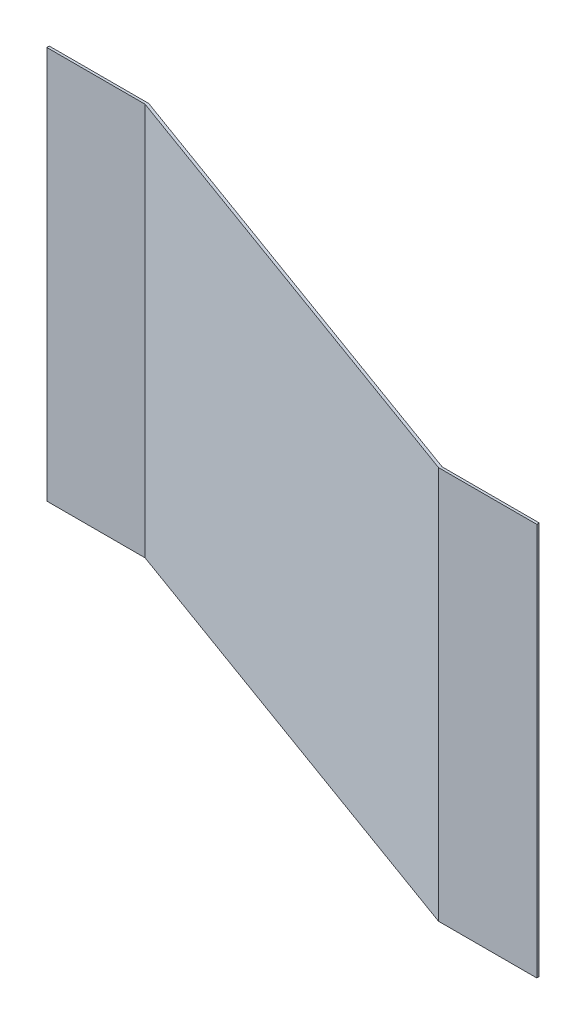
ISO-10303-21;
HEADER;
FILE_DESCRIPTION(('STEP AP214'),'2;1');
FILE_NAME('part.step','',(''),(''),'','','');
FILE_SCHEMA(('AUTOMOTIVE_DESIGN { 1 0 10303 214 1 1 1 1 }'));
ENDSEC;
DATA;
#1=APPLICATION_CONTEXT('core data for automotive mechanical design processes');
#2=APPLICATION_PROTOCOL_DEFINITION('international standard','automotive_design',2000,#1);
#3=PRODUCT_CONTEXT('',#1,'mechanical');
#4=PRODUCT('Part','Part','',(#3));
#5=PRODUCT_RELATED_PRODUCT_CATEGORY('part','',(#4));
#6=PRODUCT_DEFINITION_FORMATION('','',#4);
#7=PRODUCT_DEFINITION_CONTEXT('part definition',#1,'design');
#8=PRODUCT_DEFINITION('design','',#6,#7);
#9=PRODUCT_DEFINITION_SHAPE('','',#8);
#10=(LENGTH_UNIT() NAMED_UNIT(*) SI_UNIT(.MILLI.,.METRE.));
#11=(NAMED_UNIT(*) PLANE_ANGLE_UNIT() SI_UNIT($,.RADIAN.));
#12=(NAMED_UNIT(*) SI_UNIT($,.STERADIAN.) SOLID_ANGLE_UNIT());
#13=UNCERTAINTY_MEASURE_WITH_UNIT(LENGTH_MEASURE(1.E-05),#10,'distance_accuracy_value','');
#14=(GEOMETRIC_REPRESENTATION_CONTEXT(3) GLOBAL_UNCERTAINTY_ASSIGNED_CONTEXT((#13)) GLOBAL_UNIT_ASSIGNED_CONTEXT((#10,
#11,#12)) REPRESENTATION_CONTEXT('',''));
#15=CARTESIAN_POINT('',(0.,0.,0.));
#16=DIRECTION('',(0.,0.,1.));
#17=DIRECTION('',(1.,0.,0.));
#18=AXIS2_PLACEMENT_3D('',#15,#16,#17);
#19=CARTESIAN_POINT('',(-10131.3319774997,40000.,0.));
#20=DIRECTION('',(0.,0.,1.));
#21=DIRECTION('',(1.,0.,0.));
#22=AXIS2_PLACEMENT_3D('',#19,#20,#21);
#23=PLANE('',#22);
#24=DIRECTION('',(-1.,0.,0.));
#25=VECTOR('',#24,1.);
#26=CARTESIAN_POINT('',(-10131.3319774997,0.,0.));
#27=LINE('',#26,#25);
#28=CARTESIAN_POINT('',(0.,0.,0.));
#29=VERTEX_POINT('',#28);
#30=CARTESIAN_POINT('',(-10131.3319774997,0.,0.));
#31=VERTEX_POINT('',#30);
#32=EDGE_CURVE('E91',#29,#31,#27,.T.);
#33=ORIENTED_EDGE('',*,*,#32,.T.);
#34=DIRECTION('',(0.,-1.,0.));
#35=VECTOR('',#34,1.);
#36=CARTESIAN_POINT('',(-10131.3319774997,40000.,0.));
#37=LINE('',#36,#35);
#38=CARTESIAN_POINT('',(-10131.3319774997,40000.,0.));
#39=VERTEX_POINT('',#38);
#40=EDGE_CURVE('E11',#39,#31,#37,.T.);
#41=ORIENTED_EDGE('',*,*,#40,.F.);
#42=DIRECTION('',(-1.,0.,0.));
#43=VECTOR('',#42,1.);
#44=CARTESIAN_POINT('',(0.,40000.,0.));
#45=LINE('',#44,#43);
#46=CARTESIAN_POINT('',(0.,40000.,0.));
#47=VERTEX_POINT('',#46);
#48=EDGE_CURVE('E97',#47,#39,#45,.T.);
#49=ORIENTED_EDGE('',*,*,#48,.F.);
#50=DIRECTION('',(0.,-1.,0.));
#51=VECTOR('',#50,1.);
#52=CARTESIAN_POINT('',(0.,40000.,0.));
#53=LINE('',#52,#51);
#54=EDGE_CURVE('E131',#47,#29,#53,.T.);
#55=ORIENTED_EDGE('',*,*,#54,.T.);
#56=EDGE_LOOP('',(#33,#41,#49,#55));
#57=FACE_BOUND('',#56,.T.);
#58=ADVANCED_FACE('F39',(#57),#23,.F.);
#59=CARTESIAN_POINT('',(-10131.3319774997,40000.,250.000000000001));
#60=DIRECTION('',(1.,0.,0.));
#61=DIRECTION('',(0.,0.,-1.));
#62=AXIS2_PLACEMENT_3D('',#59,#60,#61);
#63=PLANE('',#62);
#64=DIRECTION('',(0.,0.,1.));
#65=VECTOR('',#64,1.);
#66=CARTESIAN_POINT('',(-10131.3319774997,0.,250.000000000001));
#67=LINE('',#66,#65);
#68=CARTESIAN_POINT('',(-10131.3319774997,0.,250.000000000001));
#69=VERTEX_POINT('',#68);
#70=EDGE_CURVE('E136',#31,#69,#67,.T.);
#71=ORIENTED_EDGE('',*,*,#70,.T.);
#72=DIRECTION('',(0.,-1.,0.));
#73=VECTOR('',#72,1.);
#74=CARTESIAN_POINT('',(-10131.3319774997,40000.,250.000000000001));
#75=LINE('',#74,#73);
#76=CARTESIAN_POINT('',(-10131.3319774997,40000.,250.000000000001));
#77=VERTEX_POINT('',#76);
#78=EDGE_CURVE('E47',#77,#69,#75,.T.);
#79=ORIENTED_EDGE('',*,*,#78,.F.);
#80=DIRECTION('',(0.,0.,1.));
#81=VECTOR('',#80,1.);
#82=CARTESIAN_POINT('',(-10131.3319774997,40000.,250.000000000001));
#83=LINE('',#82,#81);
#84=EDGE_CURVE('E168',#39,#77,#83,.T.);
#85=ORIENTED_EDGE('',*,*,#84,.F.);
#86=ORIENTED_EDGE('',*,*,#40,.T.);
#87=EDGE_LOOP('',(#71,#79,#85,#86));
#88=FACE_BOUND('',#87,.T.);
#89=ADVANCED_FACE('F167',(#88),#63,.F.);
#90=CARTESIAN_POINT('',(-120.740977499744,40000.,250.));
#91=DIRECTION('',(0.,0.,-1.));
#92=DIRECTION('',(-1.,0.,0.));
#93=AXIS2_PLACEMENT_3D('',#90,#91,#92);
#94=PLANE('',#93);
#95=DIRECTION('',(1.,0.,0.));
#96=VECTOR('',#95,1.);
#97=CARTESIAN_POINT('',(-120.740977499744,0.,250.));
#98=LINE('',#97,#96);
#99=CARTESIAN_POINT('',(-120.740977499744,0.,250.));
#100=VERTEX_POINT('',#99);
#101=EDGE_CURVE('E139',#69,#100,#98,.T.);
#102=ORIENTED_EDGE('',*,*,#101,.T.);
#103=DIRECTION('',(0.,-1.,0.));
#104=VECTOR('',#103,1.);
#105=CARTESIAN_POINT('',(-120.740977499744,40000.,250.));
#106=LINE('',#105,#104);
#107=CARTESIAN_POINT('',(-120.740977499744,40000.,250.));
#108=VERTEX_POINT('',#107);
#109=EDGE_CURVE('E156',#108,#100,#106,.T.);
#110=ORIENTED_EDGE('',*,*,#109,.F.);
#111=DIRECTION('',(1.,0.,0.));
#112=VECTOR('',#111,1.);
#113=CARTESIAN_POINT('',(-131.331977499744,40000.,250.));
#114=LINE('',#113,#112);
#115=EDGE_CURVE('E164',#77,#108,#114,.T.);
#116=ORIENTED_EDGE('',*,*,#115,.F.);
#117=ORIENTED_EDGE('',*,*,#78,.T.);
#118=EDGE_LOOP('',(#102,#110,#116,#117));
#119=FACE_BOUND('',#118,.T.);
#120=ADVANCED_FACE('F162',(#119),#94,.F.);
#121=CARTESIAN_POINT('',(-120.740977499744,40000.,250.));
#122=DIRECTION('',(0.342087887642722,0.,-0.939667961105486));
#123=DIRECTION('',(-0.939667961105486,0.,-0.342087887642722));
#124=AXIS2_PLACEMENT_3D('',#121,#122,#123);
#125=PLANE('',#124);
#126=DIRECTION('',(0.939667961105486,0.,0.342087887642722));
#127=VECTOR('',#126,1.);
#128=CARTESIAN_POINT('',(-120.740977499744,0.,250.));
#129=LINE('',#128,#127);
#130=CARTESIAN_POINT('',(46862.6570777745,0.,17354.3943821361));
#131=VERTEX_POINT('',#130);
#132=EDGE_CURVE('E141',#100,#131,#129,.T.);
#133=ORIENTED_EDGE('',*,*,#132,.T.);
#134=DIRECTION('',(0.,-1.,0.));
#135=VECTOR('',#134,1.);
#136=CARTESIAN_POINT('',(46862.6570777745,40000.,17354.3943821361));
#137=LINE('',#136,#135);
#138=CARTESIAN_POINT('',(46862.6570777745,40000.,17354.3943821361));
#139=VERTEX_POINT('',#138);
#140=EDGE_CURVE('E153',#139,#131,#137,.T.);
#141=ORIENTED_EDGE('',*,*,#140,.F.);
#142=DIRECTION('',(0.939667961105486,0.,0.342087887642722));
#143=VECTOR('',#142,1.);
#144=CARTESIAN_POINT('',(-120.740977499744,40000.,250.));
#145=LINE('',#144,#143);
#146=EDGE_CURVE('E178',#108,#139,#145,.T.);
#147=ORIENTED_EDGE('',*,*,#146,.F.);
#148=ORIENTED_EDGE('',*,*,#109,.T.);
#149=EDGE_LOOP('',(#133,#141,#147,#148));
#150=FACE_BOUND('',#149,.T.);
#151=ADVANCED_FACE('F174',(#150),#125,.F.);
#152=CARTESIAN_POINT('',(46862.6570777745,40000.,17354.3943821361));
#153=DIRECTION('',(0.,0.,-1.));
#154=DIRECTION('',(-1.,0.,0.));
#155=AXIS2_PLACEMENT_3D('',#152,#153,#154);
#156=PLANE('',#155);
#157=DIRECTION('',(1.,0.,0.));
#158=VECTOR('',#157,1.);
#159=CARTESIAN_POINT('',(46862.6570777745,0.,17354.3943821361));
#160=LINE('',#159,#158);
#161=CARTESIAN_POINT('',(56862.6570777745,0.,17354.3943821361));
#162=VERTEX_POINT('',#161);
#163=EDGE_CURVE('E143',#131,#162,#160,.T.);
#164=ORIENTED_EDGE('',*,*,#163,.T.);
#165=DIRECTION('',(0.,-1.,0.));
#166=VECTOR('',#165,1.);
#167=CARTESIAN_POINT('',(56862.6570777745,40000.,17354.3943821361));
#168=LINE('',#167,#166);
#169=CARTESIAN_POINT('',(56862.6570777745,40000.,17354.3943821361));
#170=VERTEX_POINT('',#169);
#171=EDGE_CURVE('E126',#170,#162,#168,.T.);
#172=ORIENTED_EDGE('',*,*,#171,.F.);
#173=DIRECTION('',(1.,0.,0.));
#174=VECTOR('',#173,1.);
#175=CARTESIAN_POINT('',(46862.6570777745,40000.,17354.3943821361));
#176=LINE('',#175,#174);
#177=EDGE_CURVE('E117',#139,#170,#176,.T.);
#178=ORIENTED_EDGE('',*,*,#177,.F.);
#179=ORIENTED_EDGE('',*,*,#140,.T.);
#180=EDGE_LOOP('',(#164,#172,#178,#179));
#181=FACE_BOUND('',#180,.T.);
#182=ADVANCED_FACE('F177',(#181),#156,.F.);
#183=CARTESIAN_POINT('',(56862.6570777745,40000.,17354.3943821361));
#184=DIRECTION('',(-1.,0.,0.));
#185=DIRECTION('',(0.,0.,1.));
#186=AXIS2_PLACEMENT_3D('',#183,#184,#185);
#187=PLANE('',#186);
#188=DIRECTION('',(0.,0.,-1.));
#189=VECTOR('',#188,1.);
#190=CARTESIAN_POINT('',(56862.6570777745,0.,17354.3943821361));
#191=LINE('',#190,#189);
#192=CARTESIAN_POINT('',(56862.6570777745,0.,17104.3943821361));
#193=VERTEX_POINT('',#192);
#194=EDGE_CURVE('E125',#162,#193,#191,.T.);
#195=ORIENTED_EDGE('',*,*,#194,.T.);
#196=DIRECTION('',(0.,-1.,0.));
#197=VECTOR('',#196,1.);
#198=CARTESIAN_POINT('',(56862.6570777745,40000.,17104.3943821361));
#199=LINE('',#198,#197);
#200=CARTESIAN_POINT('',(56862.6570777745,40000.,17104.3943821361));
#201=VERTEX_POINT('',#200);
#202=EDGE_CURVE('E122',#201,#193,#199,.T.);
#203=ORIENTED_EDGE('',*,*,#202,.F.);
#204=DIRECTION('',(0.,0.,-1.));
#205=VECTOR('',#204,1.);
#206=CARTESIAN_POINT('',(56862.6570777745,40000.,17354.3943821361));
#207=LINE('',#206,#205);
#208=EDGE_CURVE('E111',#170,#201,#207,.T.);
#209=ORIENTED_EDGE('',*,*,#208,.F.);
#210=ORIENTED_EDGE('',*,*,#171,.T.);
#211=EDGE_LOOP('',(#195,#203,#209,#210));
#212=FACE_BOUND('',#211,.T.);
#213=ADVANCED_FACE('F123',(#212),#187,.F.);
#214=CARTESIAN_POINT('',(46983.3980552743,40000.,17104.3943821361));
#215=DIRECTION('',(0.,0.,1.));
#216=DIRECTION('',(1.,0.,0.));
#217=AXIS2_PLACEMENT_3D('',#214,#215,#216);
#218=PLANE('',#217);
#219=DIRECTION('',(-1.,0.,0.));
#220=VECTOR('',#219,1.);
#221=CARTESIAN_POINT('',(46983.3980552743,0.,17104.3943821361));
#222=LINE('',#221,#220);
#223=CARTESIAN_POINT('',(46983.3980552743,0.,17104.3943821361));
#224=VERTEX_POINT('',#223);
#225=EDGE_CURVE('E84',#193,#224,#222,.T.);
#226=ORIENTED_EDGE('',*,*,#225,.T.);
#227=DIRECTION('',(0.,-1.,0.));
#228=VECTOR('',#227,1.);
#229=CARTESIAN_POINT('',(46983.3980552743,40000.,17104.3943821361));
#230=LINE('',#229,#228);
#231=CARTESIAN_POINT('',(46983.3980552743,40000.,17104.3943821361));
#232=VERTEX_POINT('',#231);
#233=EDGE_CURVE('E127',#232,#224,#230,.T.);
#234=ORIENTED_EDGE('',*,*,#233,.F.);
#235=DIRECTION('',(-1.,0.,0.));
#236=VECTOR('',#235,1.);
#237=CARTESIAN_POINT('',(46983.3980552743,40000.,17104.3943821361));
#238=LINE('',#237,#236);
#239=EDGE_CURVE('E115',#201,#232,#238,.T.);
#240=ORIENTED_EDGE('',*,*,#239,.F.);
#241=ORIENTED_EDGE('',*,*,#202,.T.);
#242=EDGE_LOOP('',(#226,#234,#240,#241));
#243=FACE_BOUND('',#242,.T.);
#244=ADVANCED_FACE('F129',(#243),#218,.F.);
#245=CARTESIAN_POINT('',(0.,40000.,0.));
#246=DIRECTION('',(-0.342087887642722,0.,0.939667961105486));
#247=DIRECTION('',(0.939667961105486,0.,0.342087887642722));
#248=AXIS2_PLACEMENT_3D('',#245,#246,#247);
#249=PLANE('',#248);
#250=DIRECTION('',(-0.939667961105486,0.,-0.342087887642722));
#251=VECTOR('',#250,1.);
#252=CARTESIAN_POINT('',(0.,0.,0.));
#253=LINE('',#252,#251);
#254=EDGE_CURVE('E147',#224,#29,#253,.T.);
#255=ORIENTED_EDGE('',*,*,#254,.T.);
#256=ORIENTED_EDGE('',*,*,#54,.F.);
#257=DIRECTION('',(-0.939667961105486,0.,-0.342087887642722));
#258=VECTOR('',#257,1.);
#259=CARTESIAN_POINT('',(0.,40000.,0.));
#260=LINE('',#259,#258);
#261=EDGE_CURVE('E55',#232,#47,#260,.T.);
#262=ORIENTED_EDGE('',*,*,#261,.F.);
#263=ORIENTED_EDGE('',*,*,#233,.T.);
#264=EDGE_LOOP('',(#255,#256,#262,#263));
#265=FACE_BOUND('',#264,.T.);
#266=ADVANCED_FACE('F184',(#265),#249,.F.);
#267=CARTESIAN_POINT('',(0.,40000.,0.));
#268=DIRECTION('',(0.,-1.,0.));
#269=DIRECTION('',(0.,0.,-1.));
#270=AXIS2_PLACEMENT_3D('',#267,#268,#269);
#271=PLANE('',#270);
#272=ORIENTED_EDGE('',*,*,#48,.T.);
#273=ORIENTED_EDGE('',*,*,#84,.T.);
#274=ORIENTED_EDGE('',*,*,#115,.T.);
#275=ORIENTED_EDGE('',*,*,#146,.T.);
#276=ORIENTED_EDGE('',*,*,#177,.T.);
#277=ORIENTED_EDGE('',*,*,#208,.T.);
#278=ORIENTED_EDGE('',*,*,#239,.T.);
#279=ORIENTED_EDGE('',*,*,#261,.T.);
#280=EDGE_LOOP('',(#272,#273,#274,#275,#276,#277,#278,#279));
#281=FACE_BOUND('',#280,.T.);
#282=ADVANCED_FACE('F113',(#281),#271,.F.);
#283=CARTESIAN_POINT('',(0.,0.,0.));
#284=DIRECTION('',(0.,-1.,0.));
#285=DIRECTION('',(0.,0.,-1.));
#286=AXIS2_PLACEMENT_3D('',#283,#284,#285);
#287=PLANE('',#286);
#288=ORIENTED_EDGE('',*,*,#32,.F.);
#289=ORIENTED_EDGE('',*,*,#254,.F.);
#290=ORIENTED_EDGE('',*,*,#225,.F.);
#291=ORIENTED_EDGE('',*,*,#194,.F.);
#292=ORIENTED_EDGE('',*,*,#163,.F.);
#293=ORIENTED_EDGE('',*,*,#132,.F.);
#294=ORIENTED_EDGE('',*,*,#101,.F.);
#295=ORIENTED_EDGE('',*,*,#70,.F.);
#296=EDGE_LOOP('',(#288,#289,#290,#291,#292,#293,#294,#295));
#297=FACE_BOUND('',#296,.T.);
#298=ADVANCED_FACE('F169',(#297),#287,.T.);
#299=CLOSED_SHELL('',(#58,#89,#120,#151,#182,#213,#244,#266,#282,#298));
#300=MANIFOLD_SOLID_BREP('B2',#299);
#301=ADVANCED_BREP_SHAPE_REPRESENTATION('',(#18,#300),#14);
#302=SHAPE_DEFINITION_REPRESENTATION(#9,#301);
ENDSEC;
END-ISO-10303-21;
